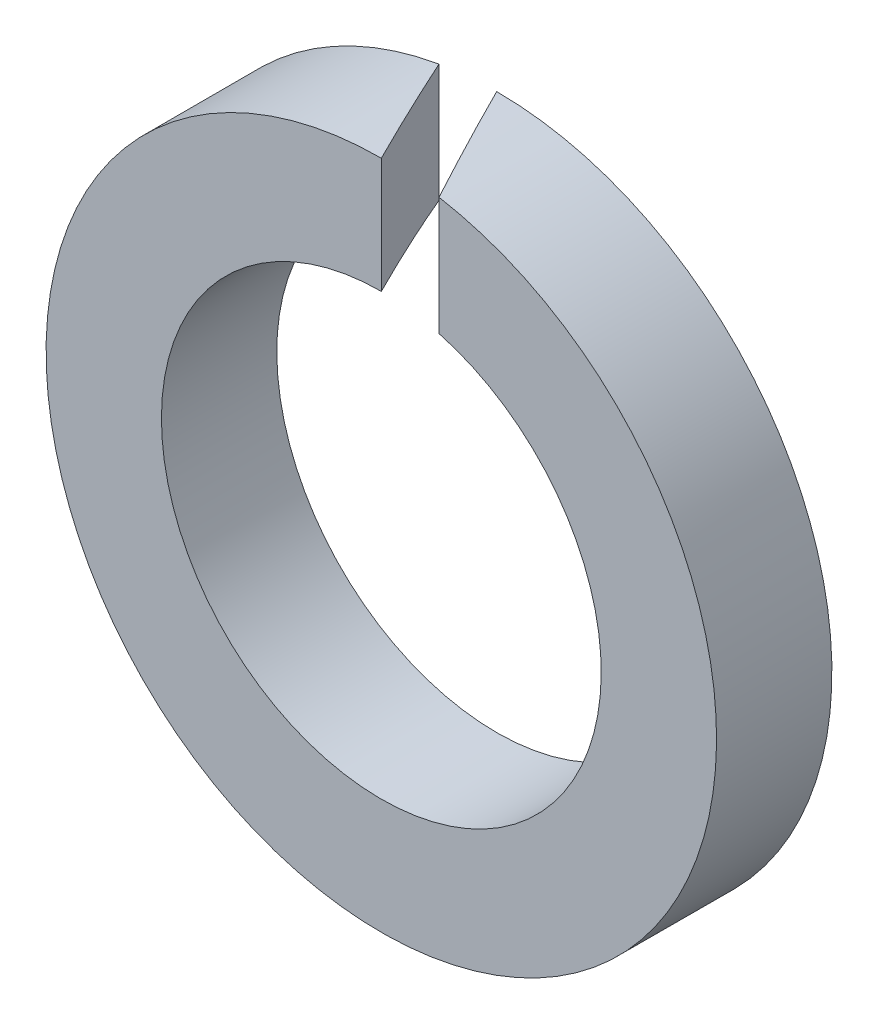
ISO-10303-21;
HEADER;
FILE_DESCRIPTION(('STEP AP214'),'2;1');
FILE_NAME('part.step','',(''),(''),'','','');
FILE_SCHEMA(('AUTOMOTIVE_DESIGN { 1 0 10303 214 1 1 1 1 }'));
ENDSEC;
DATA;
#1=APPLICATION_CONTEXT('core data for automotive mechanical design processes');
#2=APPLICATION_PROTOCOL_DEFINITION('international standard','automotive_design',2000,#1);
#3=PRODUCT_CONTEXT('',#1,'mechanical');
#4=PRODUCT('Part','Part','',(#3));
#5=PRODUCT_RELATED_PRODUCT_CATEGORY('part','',(#4));
#6=PRODUCT_DEFINITION_FORMATION('','',#4);
#7=PRODUCT_DEFINITION_CONTEXT('part definition',#1,'design');
#8=PRODUCT_DEFINITION('design','',#6,#7);
#9=PRODUCT_DEFINITION_SHAPE('','',#8);
#10=(LENGTH_UNIT() NAMED_UNIT(*) SI_UNIT(.MILLI.,.METRE.));
#11=(NAMED_UNIT(*) PLANE_ANGLE_UNIT() SI_UNIT($,.RADIAN.));
#12=(NAMED_UNIT(*) SI_UNIT($,.STERADIAN.) SOLID_ANGLE_UNIT());
#13=UNCERTAINTY_MEASURE_WITH_UNIT(LENGTH_MEASURE(1.E-05),#10,'distance_accuracy_value','');
#14=(GEOMETRIC_REPRESENTATION_CONTEXT(3) GLOBAL_UNCERTAINTY_ASSIGNED_CONTEXT((#13)) GLOBAL_UNIT_ASSIGNED_CONTEXT((#10,
#11,#12)) REPRESENTATION_CONTEXT('',''));
#15=CARTESIAN_POINT('',(0.,0.,0.));
#16=DIRECTION('',(0.,0.,1.));
#17=DIRECTION('',(1.,0.,0.));
#18=AXIS2_PLACEMENT_3D('',#15,#16,#17);
#19=CARTESIAN_POINT('',(0.8,0.,1.6));
#20=DIRECTION('',(0.894427190999916,0.,-0.447213595499958));
#21=DIRECTION('',(-0.447213595499958,0.,-0.894427190999916));
#22=AXIS2_PLACEMENT_3D('',#19,#20,#21);
#23=PLANE('',#22);
#24=CARTESIAN_POINT('',(0.,0.,0.));
#25=DIRECTION('',(0.894427190999916,0.,-0.447213595499958));
#26=DIRECTION('',(0.447213595499958,0.,0.894427190999916));
#27=AXIS2_PLACEMENT_3D('',#24,#25,#26);
#28=ELLIPSE('',#27,6.82000733137436,3.05);
#29=CARTESIAN_POINT('',(0.,3.05,0.));
#30=VERTEX_POINT('',#29);
#31=CARTESIAN_POINT('',(0.8,2.94321253055229,1.6));
#32=VERTEX_POINT('',#31);
#33=EDGE_CURVE('E75',#30,#32,#28,.T.);
#34=ORIENTED_EDGE('',*,*,#33,.T.);
#35=DIRECTION('',(0.,1.,0.));
#36=VECTOR('',#35,1.);
#37=CARTESIAN_POINT('',(0.8,0.,1.6));
#38=LINE('',#37,#36);
#39=CARTESIAN_POINT('',(0.8,4.58066589045741,1.6));
#40=VERTEX_POINT('',#39);
#41=EDGE_CURVE('E68',#40,#32,#38,.F.);
#42=ORIENTED_EDGE('',*,*,#41,.F.);
#43=CARTESIAN_POINT('',(0.,0.,0.));
#44=DIRECTION('',(0.894427190999916,0.,-0.447213595499958));
#45=DIRECTION('',(0.447213595499958,0.,0.894427190999916));
#46=AXIS2_PLACEMENT_3D('',#43,#44,#45);
#47=ELLIPSE('',#46,10.397716095374,4.65);
#48=CARTESIAN_POINT('',(0.,4.65,0.));
#49=VERTEX_POINT('',#48);
#50=EDGE_CURVE('E77',#49,#40,#47,.T.);
#51=ORIENTED_EDGE('',*,*,#50,.F.);
#52=DIRECTION('',(0.,1.,0.));
#53=VECTOR('',#52,1.);
#54=CARTESIAN_POINT('',(0.,0.,0.));
#55=LINE('',#54,#53);
#56=EDGE_CURVE('E35',#30,#49,#55,.T.);
#57=ORIENTED_EDGE('',*,*,#56,.F.);
#58=EDGE_LOOP('',(#34,#42,#51,#57));
#59=FACE_BOUND('',#58,.T.);
#60=ADVANCED_FACE('F17',(#59),#23,.F.);
#61=CARTESIAN_POINT('',(0.,0.,1.6));
#62=DIRECTION('',(0.,0.,1.));
#63=DIRECTION('',(1.,0.,0.));
#64=AXIS2_PLACEMENT_3D('',#61,#62,#63);
#65=PLANE('',#64);
#66=CARTESIAN_POINT('',(0.,0.,1.6));
#67=DIRECTION('',(0.,0.,1.));
#68=DIRECTION('',(1.,0.,0.));
#69=AXIS2_PLACEMENT_3D('',#66,#67,#68);
#70=CIRCLE('',#69,3.05);
#71=CARTESIAN_POINT('',(0.,3.05,1.6));
#72=VERTEX_POINT('',#71);
#73=EDGE_CURVE('E71',#32,#72,#70,.F.);
#74=ORIENTED_EDGE('',*,*,#73,.T.);
#75=DIRECTION('',(0.,1.,0.));
#76=VECTOR('',#75,1.);
#77=CARTESIAN_POINT('',(0.,0.,1.6));
#78=LINE('',#77,#76);
#79=CARTESIAN_POINT('',(0.,4.65,1.6));
#80=VERTEX_POINT('',#79);
#81=EDGE_CURVE('E62',#72,#80,#78,.T.);
#82=ORIENTED_EDGE('',*,*,#81,.T.);
#83=CARTESIAN_POINT('',(0.,0.,1.6));
#84=DIRECTION('',(0.,0.,1.));
#85=DIRECTION('',(1.,0.,0.));
#86=AXIS2_PLACEMENT_3D('',#83,#84,#85);
#87=CIRCLE('',#86,4.65);
#88=EDGE_CURVE('E82',#40,#80,#87,.F.);
#89=ORIENTED_EDGE('',*,*,#88,.F.);
#90=ORIENTED_EDGE('',*,*,#41,.T.);
#91=EDGE_LOOP('',(#74,#82,#89,#90));
#92=FACE_BOUND('',#91,.T.);
#93=ADVANCED_FACE('F74',(#92),#65,.T.);
#94=CARTESIAN_POINT('',(-0.8,0.,0.));
#95=DIRECTION('',(-0.894427190999916,0.,0.447213595499958));
#96=DIRECTION('',(0.447213595499958,0.,0.894427190999916));
#97=AXIS2_PLACEMENT_3D('',#94,#95,#96);
#98=PLANE('',#97);
#99=CARTESIAN_POINT('',(0.,0.,1.6));
#100=DIRECTION('',(-0.894427190999916,0.,0.447213595499958));
#101=DIRECTION('',(0.447213595499958,0.,0.894427190999916));
#102=AXIS2_PLACEMENT_3D('',#99,#100,#101);
#103=ELLIPSE('',#102,10.397716095374,4.65);
#104=CARTESIAN_POINT('',(-0.8,4.58066589045741,0.));
#105=VERTEX_POINT('',#104);
#106=EDGE_CURVE('E20',#80,#105,#103,.T.);
#107=ORIENTED_EDGE('',*,*,#106,.F.);
#108=ORIENTED_EDGE('',*,*,#81,.F.);
#109=CARTESIAN_POINT('',(0.,0.,1.6));
#110=DIRECTION('',(-0.894427190999916,0.,0.447213595499958));
#111=DIRECTION('',(0.447213595499958,0.,0.894427190999916));
#112=AXIS2_PLACEMENT_3D('',#109,#110,#111);
#113=ELLIPSE('',#112,6.82000733137436,3.05);
#114=CARTESIAN_POINT('',(-0.8,2.94321253055229,0.));
#115=VERTEX_POINT('',#114);
#116=EDGE_CURVE('E64',#72,#115,#113,.T.);
#117=ORIENTED_EDGE('',*,*,#116,.T.);
#118=DIRECTION('',(0.,1.,0.));
#119=VECTOR('',#118,1.);
#120=CARTESIAN_POINT('',(-0.8,0.,0.));
#121=LINE('',#120,#119);
#122=EDGE_CURVE('E55',#105,#115,#121,.F.);
#123=ORIENTED_EDGE('',*,*,#122,.F.);
#124=EDGE_LOOP('',(#107,#108,#117,#123));
#125=FACE_BOUND('',#124,.T.);
#126=ADVANCED_FACE('F63',(#125),#98,.F.);
#127=CARTESIAN_POINT('',(0.,0.,0.));
#128=DIRECTION('',(0.,0.,1.));
#129=DIRECTION('',(1.,0.,0.));
#130=AXIS2_PLACEMENT_3D('',#127,#128,#129);
#131=CYLINDRICAL_SURFACE('',#130,4.65);
#132=CARTESIAN_POINT('',(0.,0.,0.));
#133=DIRECTION('',(0.,0.,1.));
#134=DIRECTION('',(1.,0.,0.));
#135=AXIS2_PLACEMENT_3D('',#132,#133,#134);
#136=CIRCLE('',#135,4.65);
#137=EDGE_CURVE('E26',#105,#49,#136,.T.);
#138=ORIENTED_EDGE('',*,*,#137,.T.);
#139=ORIENTED_EDGE('',*,*,#50,.T.);
#140=ORIENTED_EDGE('',*,*,#88,.T.);
#141=ORIENTED_EDGE('',*,*,#106,.T.);
#142=EDGE_LOOP('',(#138,#139,#140,#141));
#143=FACE_BOUND('',#142,.T.);
#144=ADVANCED_FACE('F90',(#143),#131,.T.);
#145=CARTESIAN_POINT('',(0.,0.,0.));
#146=DIRECTION('',(0.,0.,1.));
#147=DIRECTION('',(1.,0.,0.));
#148=AXIS2_PLACEMENT_3D('',#145,#146,#147);
#149=CYLINDRICAL_SURFACE('',#148,3.05);
#150=CARTESIAN_POINT('',(0.,0.,0.));
#151=DIRECTION('',(0.,0.,1.));
#152=DIRECTION('',(1.,0.,0.));
#153=AXIS2_PLACEMENT_3D('',#150,#151,#152);
#154=CIRCLE('',#153,3.05);
#155=EDGE_CURVE('E11',#30,#115,#154,.F.);
#156=ORIENTED_EDGE('',*,*,#155,.T.);
#157=ORIENTED_EDGE('',*,*,#116,.F.);
#158=ORIENTED_EDGE('',*,*,#73,.F.);
#159=ORIENTED_EDGE('',*,*,#33,.F.);
#160=EDGE_LOOP('',(#156,#157,#158,#159));
#161=FACE_BOUND('',#160,.T.);
#162=ADVANCED_FACE('F70',(#161),#149,.F.);
#163=CARTESIAN_POINT('',(0.,0.,0.));
#164=DIRECTION('',(0.,0.,1.));
#165=DIRECTION('',(1.,0.,0.));
#166=AXIS2_PLACEMENT_3D('',#163,#164,#165);
#167=PLANE('',#166);
#168=ORIENTED_EDGE('',*,*,#155,.F.);
#169=ORIENTED_EDGE('',*,*,#56,.T.);
#170=ORIENTED_EDGE('',*,*,#137,.F.);
#171=ORIENTED_EDGE('',*,*,#122,.T.);
#172=EDGE_LOOP('',(#168,#169,#170,#171));
#173=FACE_BOUND('',#172,.T.);
#174=ADVANCED_FACE('F91',(#173),#167,.F.);
#175=CLOSED_SHELL('',(#60,#93,#126,#144,#162,#174));
#176=MANIFOLD_SOLID_BREP('B1',#175);
#177=ADVANCED_BREP_SHAPE_REPRESENTATION('',(#18,#176),#14);
#178=SHAPE_DEFINITION_REPRESENTATION(#9,#177);
ENDSEC;
END-ISO-10303-21;
